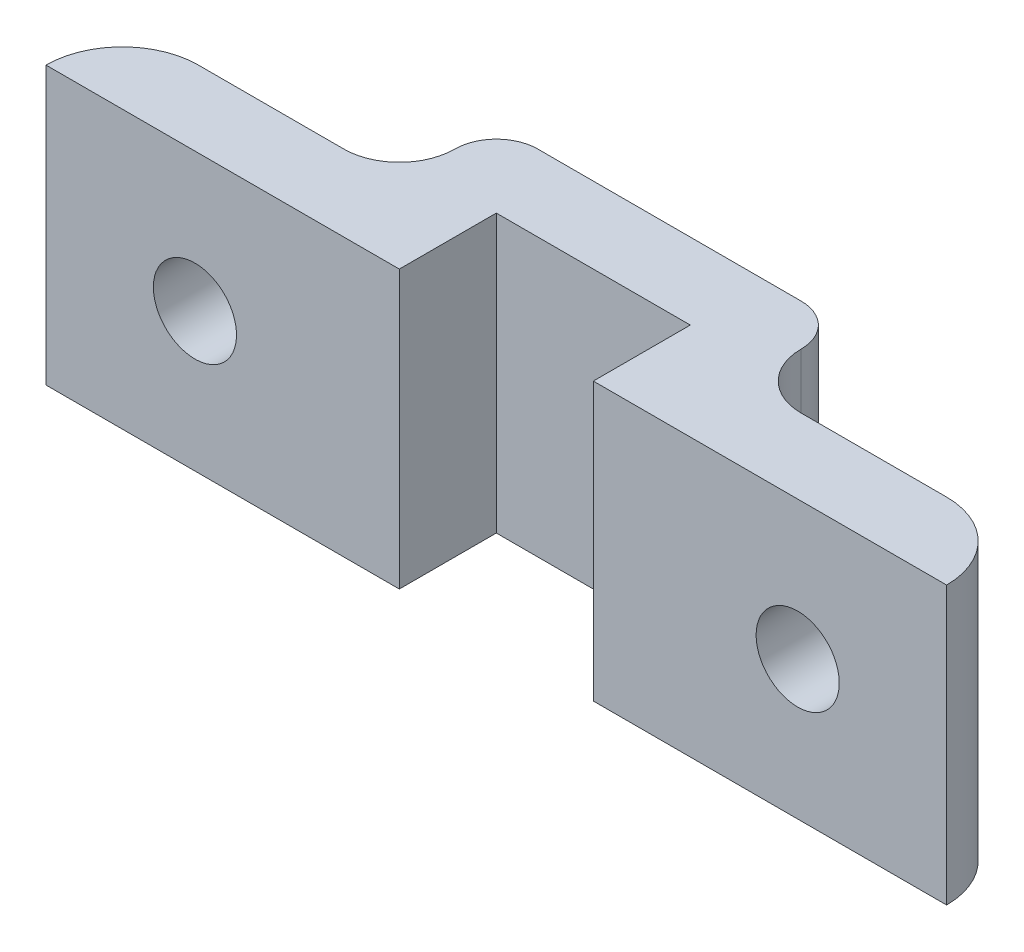
ISO-10303-21;
HEADER;
FILE_DESCRIPTION(('STEP AP214'),'2;1');
FILE_NAME('part.step','',(''),(''),'','','');
FILE_SCHEMA(('AUTOMOTIVE_DESIGN { 1 0 10303 214 1 1 1 1 }'));
ENDSEC;
DATA;
#1=APPLICATION_CONTEXT('core data for automotive mechanical design processes');
#2=APPLICATION_PROTOCOL_DEFINITION('international standard','automotive_design',2000,#1);
#3=PRODUCT_CONTEXT('',#1,'mechanical');
#4=PRODUCT('Part','Part','',(#3));
#5=PRODUCT_RELATED_PRODUCT_CATEGORY('part','',(#4));
#6=PRODUCT_DEFINITION_FORMATION('','',#4);
#7=PRODUCT_DEFINITION_CONTEXT('part definition',#1,'design');
#8=PRODUCT_DEFINITION('design','',#6,#7);
#9=PRODUCT_DEFINITION_SHAPE('','',#8);
#10=(LENGTH_UNIT() NAMED_UNIT(*) SI_UNIT(.MILLI.,.METRE.));
#11=(NAMED_UNIT(*) PLANE_ANGLE_UNIT() SI_UNIT($,.RADIAN.));
#12=(NAMED_UNIT(*) SI_UNIT($,.STERADIAN.) SOLID_ANGLE_UNIT());
#13=UNCERTAINTY_MEASURE_WITH_UNIT(LENGTH_MEASURE(1.E-05),#10,'distance_accuracy_value','');
#14=(GEOMETRIC_REPRESENTATION_CONTEXT(3) GLOBAL_UNCERTAINTY_ASSIGNED_CONTEXT((#13)) GLOBAL_UNIT_ASSIGNED_CONTEXT((#10,
#11,#12)) REPRESENTATION_CONTEXT('',''));
#15=CARTESIAN_POINT('',(0.,0.,0.));
#16=DIRECTION('',(0.,0.,1.));
#17=DIRECTION('',(1.,0.,0.));
#18=AXIS2_PLACEMENT_3D('',#15,#16,#17);
#19=CARTESIAN_POINT('',(-13.5,-10.,3.125));
#20=DIRECTION('',(0.,1.,0.));
#21=DIRECTION('',(0.,0.,1.));
#22=AXIS2_PLACEMENT_3D('',#19,#20,#21);
#23=CYLINDRICAL_SURFACE('',#22,2.75);
#24=CARTESIAN_POINT('',(-13.5,0.,3.125));
#25=DIRECTION('',(0.,-1.,0.));
#26=DIRECTION('',(0.,0.,-1.));
#27=AXIS2_PLACEMENT_3D('',#24,#25,#26);
#28=CIRCLE('',#27,2.75);
#29=CARTESIAN_POINT('',(-16.25,0.,3.125));
#30=VERTEX_POINT('',#29);
#31=CARTESIAN_POINT('',(-13.5,0.,0.375));
#32=VERTEX_POINT('',#31);
#33=EDGE_CURVE('E191',#30,#32,#28,.T.);
#34=ORIENTED_EDGE('',*,*,#33,.T.);
#35=DIRECTION('',(0.,1.,0.));
#36=VECTOR('',#35,1.);
#37=CARTESIAN_POINT('',(-13.5,-10.,0.375));
#38=LINE('',#37,#36);
#39=CARTESIAN_POINT('',(-13.5,-10.,0.375));
#40=VERTEX_POINT('',#39);
#41=EDGE_CURVE('E10',#40,#32,#38,.T.);
#42=ORIENTED_EDGE('',*,*,#41,.F.);
#43=CARTESIAN_POINT('',(-13.5,-10.,3.125));
#44=DIRECTION('',(0.,-1.,0.));
#45=DIRECTION('',(0.,0.,-1.));
#46=AXIS2_PLACEMENT_3D('',#43,#44,#45);
#47=CIRCLE('',#46,2.75);
#48=CARTESIAN_POINT('',(-16.25,-10.,3.125));
#49=VERTEX_POINT('',#48);
#50=EDGE_CURVE('E240',#49,#40,#47,.T.);
#51=ORIENTED_EDGE('',*,*,#50,.F.);
#52=DIRECTION('',(0.,1.,0.));
#53=VECTOR('',#52,1.);
#54=CARTESIAN_POINT('',(-16.25,-10.,3.125));
#55=LINE('',#54,#53);
#56=EDGE_CURVE('E187',#49,#30,#55,.T.);
#57=ORIENTED_EDGE('',*,*,#56,.T.);
#58=EDGE_LOOP('',(#34,#42,#51,#57));
#59=FACE_BOUND('',#58,.T.);
#60=ADVANCED_FACE('F16',(#59),#23,.T.);
#61=CARTESIAN_POINT('',(-10.875,-10.,0.375));
#62=DIRECTION('',(0.,0.,1.));
#63=DIRECTION('',(1.,0.,0.));
#64=AXIS2_PLACEMENT_3D('',#61,#62,#63);
#65=PLANE('',#64);
#66=CARTESIAN_POINT('',(-10.875,-5.,0.375));
#67=DIRECTION('',(0.,0.,-1.));
#68=DIRECTION('',(-1.,0.,0.));
#69=AXIS2_PLACEMENT_3D('',#66,#67,#68);
#70=CIRCLE('',#69,1.5);
#71=CARTESIAN_POINT('',(-12.375,-5.,0.375));
#72=VERTEX_POINT('',#71);
#73=EDGE_CURVE('E284',#72,#72,#70,.T.);
#74=ORIENTED_EDGE('',*,*,#73,.F.);
#75=EDGE_LOOP('',(#74));
#76=FACE_BOUND('',#75,.T.);
#77=DIRECTION('',(1.,0.,0.));
#78=VECTOR('',#77,1.);
#79=CARTESIAN_POINT('',(-10.875,0.,0.375));
#80=LINE('',#79,#78);
#81=CARTESIAN_POINT('',(-8.25,0.,0.375));
#82=VERTEX_POINT('',#81);
#83=EDGE_CURVE('E195',#32,#82,#80,.T.);
#84=ORIENTED_EDGE('',*,*,#83,.T.);
#85=DIRECTION('',(0.,1.,0.));
#86=VECTOR('',#85,1.);
#87=CARTESIAN_POINT('',(-8.25,-10.,0.375));
#88=LINE('',#87,#86);
#89=CARTESIAN_POINT('',(-8.25,-10.,0.375));
#90=VERTEX_POINT('',#89);
#91=EDGE_CURVE('E26',#90,#82,#88,.T.);
#92=ORIENTED_EDGE('',*,*,#91,.F.);
#93=DIRECTION('',(1.,0.,0.));
#94=VECTOR('',#93,1.);
#95=CARTESIAN_POINT('',(-10.875,-10.,0.375));
#96=LINE('',#95,#94);
#97=EDGE_CURVE('E115',#40,#90,#96,.T.);
#98=ORIENTED_EDGE('',*,*,#97,.F.);
#99=ORIENTED_EDGE('',*,*,#41,.T.);
#100=EDGE_LOOP('',(#84,#92,#98,#99));
#101=FACE_BOUND('',#100,.T.);
#102=ADVANCED_FACE('F350',(#76,#101),#65,.F.);
#103=CARTESIAN_POINT('',(-8.25,-10.,-1.625));
#104=DIRECTION('',(0.,1.,0.));
#105=DIRECTION('',(0.,0.,1.));
#106=AXIS2_PLACEMENT_3D('',#103,#104,#105);
#107=CYLINDRICAL_SURFACE('',#106,2.);
#108=CARTESIAN_POINT('',(-8.25,0.,-1.625));
#109=DIRECTION('',(0.,-1.,0.));
#110=DIRECTION('',(0.,0.,-1.));
#111=AXIS2_PLACEMENT_3D('',#108,#109,#110);
#112=CIRCLE('',#111,2.);
#113=CARTESIAN_POINT('',(-6.25,0.,-1.625));
#114=VERTEX_POINT('',#113);
#115=EDGE_CURVE('E199',#114,#82,#112,.T.);
#116=ORIENTED_EDGE('',*,*,#115,.F.);
#117=DIRECTION('',(0.,1.,0.));
#118=VECTOR('',#117,1.);
#119=CARTESIAN_POINT('',(-6.25,-10.,-1.625));
#120=LINE('',#119,#118);
#121=CARTESIAN_POINT('',(-6.25,-10.,-1.625));
#122=VERTEX_POINT('',#121);
#123=EDGE_CURVE('E268',#122,#114,#120,.T.);
#124=ORIENTED_EDGE('',*,*,#123,.F.);
#125=CARTESIAN_POINT('',(-8.25,-10.,-1.625));
#126=DIRECTION('',(0.,-1.,0.));
#127=DIRECTION('',(0.,0.,-1.));
#128=AXIS2_PLACEMENT_3D('',#125,#126,#127);
#129=CIRCLE('',#128,2.);
#130=EDGE_CURVE('E298',#122,#90,#129,.T.);
#131=ORIENTED_EDGE('',*,*,#130,.T.);
#132=ORIENTED_EDGE('',*,*,#91,.T.);
#133=EDGE_LOOP('',(#116,#124,#131,#132));
#134=FACE_BOUND('',#133,.T.);
#135=ADVANCED_FACE('F354',(#134),#107,.F.);
#136=CARTESIAN_POINT('',(-4.75,-10.,-1.625));
#137=DIRECTION('',(0.,1.,0.));
#138=DIRECTION('',(0.,0.,1.));
#139=AXIS2_PLACEMENT_3D('',#136,#137,#138);
#140=CYLINDRICAL_SURFACE('',#139,1.5);
#141=CARTESIAN_POINT('',(-4.75,0.,-1.625));
#142=DIRECTION('',(0.,-1.,0.));
#143=DIRECTION('',(0.,0.,-1.));
#144=AXIS2_PLACEMENT_3D('',#141,#142,#143);
#145=CIRCLE('',#144,1.5);
#146=CARTESIAN_POINT('',(-4.75,0.,-3.125));
#147=VERTEX_POINT('',#146);
#148=EDGE_CURVE('E203',#114,#147,#145,.T.);
#149=ORIENTED_EDGE('',*,*,#148,.T.);
#150=DIRECTION('',(0.,1.,0.));
#151=VECTOR('',#150,1.);
#152=CARTESIAN_POINT('',(-4.75,-10.,-3.125));
#153=LINE('',#152,#151);
#154=CARTESIAN_POINT('',(-4.75,-10.,-3.125));
#155=VERTEX_POINT('',#154);
#156=EDGE_CURVE('E265',#155,#147,#153,.T.);
#157=ORIENTED_EDGE('',*,*,#156,.F.);
#158=CARTESIAN_POINT('',(-4.75,-10.,-1.625));
#159=DIRECTION('',(0.,-1.,0.));
#160=DIRECTION('',(0.,0.,-1.));
#161=AXIS2_PLACEMENT_3D('',#158,#159,#160);
#162=CIRCLE('',#161,1.5);
#163=EDGE_CURVE('E302',#122,#155,#162,.T.);
#164=ORIENTED_EDGE('',*,*,#163,.F.);
#165=ORIENTED_EDGE('',*,*,#123,.T.);
#166=EDGE_LOOP('',(#149,#157,#164,#165));
#167=FACE_BOUND('',#166,.T.);
#168=ADVANCED_FACE('F359',(#167),#140,.T.);
#169=CARTESIAN_POINT('',(-4.125,-10.,-3.125));
#170=DIRECTION('',(0.,0.,-1.));
#171=DIRECTION('',(-1.,0.,0.));
#172=AXIS2_PLACEMENT_3D('',#169,#170,#171);
#173=PLANE('',#172);
#174=DIRECTION('',(-1.,0.,0.));
#175=VECTOR('',#174,1.);
#176=CARTESIAN_POINT('',(-4.125,0.,-3.125));
#177=LINE('',#176,#175);
#178=CARTESIAN_POINT('',(4.75,0.,-3.125));
#179=VERTEX_POINT('',#178);
#180=EDGE_CURVE('E207',#179,#147,#177,.T.);
#181=ORIENTED_EDGE('',*,*,#180,.F.);
#182=DIRECTION('',(0.,1.,0.));
#183=VECTOR('',#182,1.);
#184=CARTESIAN_POINT('',(4.75,-10.,-3.125));
#185=LINE('',#184,#183);
#186=CARTESIAN_POINT('',(4.75,-10.,-3.125));
#187=VERTEX_POINT('',#186);
#188=EDGE_CURVE('E262',#187,#179,#185,.T.);
#189=ORIENTED_EDGE('',*,*,#188,.F.);
#190=DIRECTION('',(-1.,0.,0.));
#191=VECTOR('',#190,1.);
#192=CARTESIAN_POINT('',(-4.125,-10.,-3.125));
#193=LINE('',#192,#191);
#194=EDGE_CURVE('E305',#187,#155,#193,.T.);
#195=ORIENTED_EDGE('',*,*,#194,.T.);
#196=ORIENTED_EDGE('',*,*,#156,.T.);
#197=EDGE_LOOP('',(#181,#189,#195,#196));
#198=FACE_BOUND('',#197,.T.);
#199=ADVANCED_FACE('F366',(#198),#173,.T.);
#200=CARTESIAN_POINT('',(4.75,-10.,-1.625));
#201=DIRECTION('',(0.,1.,0.));
#202=DIRECTION('',(0.,0.,1.));
#203=AXIS2_PLACEMENT_3D('',#200,#201,#202);
#204=CYLINDRICAL_SURFACE('',#203,1.5);
#205=CARTESIAN_POINT('',(4.75,0.,-1.625));
#206=DIRECTION('',(0.,-1.,0.));
#207=DIRECTION('',(0.,0.,-1.));
#208=AXIS2_PLACEMENT_3D('',#205,#206,#207);
#209=CIRCLE('',#208,1.5);
#210=CARTESIAN_POINT('',(6.25,0.,-1.625));
#211=VERTEX_POINT('',#210);
#212=EDGE_CURVE('E211',#179,#211,#209,.T.);
#213=ORIENTED_EDGE('',*,*,#212,.T.);
#214=DIRECTION('',(0.,1.,0.));
#215=VECTOR('',#214,1.);
#216=CARTESIAN_POINT('',(6.25,-10.,-1.625));
#217=LINE('',#216,#215);
#218=CARTESIAN_POINT('',(6.25,-10.,-1.625));
#219=VERTEX_POINT('',#218);
#220=EDGE_CURVE('E259',#219,#211,#217,.T.);
#221=ORIENTED_EDGE('',*,*,#220,.F.);
#222=CARTESIAN_POINT('',(4.75,-10.,-1.625));
#223=DIRECTION('',(0.,-1.,0.));
#224=DIRECTION('',(0.,0.,-1.));
#225=AXIS2_PLACEMENT_3D('',#222,#223,#224);
#226=CIRCLE('',#225,1.5);
#227=EDGE_CURVE('E309',#187,#219,#226,.T.);
#228=ORIENTED_EDGE('',*,*,#227,.F.);
#229=ORIENTED_EDGE('',*,*,#188,.T.);
#230=EDGE_LOOP('',(#213,#221,#228,#229));
#231=FACE_BOUND('',#230,.T.);
#232=ADVANCED_FACE('F370',(#231),#204,.T.);
#233=CARTESIAN_POINT('',(8.25,-10.,-1.625));
#234=DIRECTION('',(0.,1.,0.));
#235=DIRECTION('',(0.,0.,1.));
#236=AXIS2_PLACEMENT_3D('',#233,#234,#235);
#237=CYLINDRICAL_SURFACE('',#236,2.);
#238=CARTESIAN_POINT('',(8.25,0.,-1.625));
#239=DIRECTION('',(0.,-1.,0.));
#240=DIRECTION('',(0.,0.,-1.));
#241=AXIS2_PLACEMENT_3D('',#238,#239,#240);
#242=CIRCLE('',#241,2.);
#243=CARTESIAN_POINT('',(8.25,0.,0.375));
#244=VERTEX_POINT('',#243);
#245=EDGE_CURVE('E215',#244,#211,#242,.T.);
#246=ORIENTED_EDGE('',*,*,#245,.F.);
#247=DIRECTION('',(0.,1.,0.));
#248=VECTOR('',#247,1.);
#249=CARTESIAN_POINT('',(8.25,-10.,0.375));
#250=LINE('',#249,#248);
#251=CARTESIAN_POINT('',(8.25,-10.,0.375));
#252=VERTEX_POINT('',#251);
#253=EDGE_CURVE('E256',#252,#244,#250,.T.);
#254=ORIENTED_EDGE('',*,*,#253,.F.);
#255=CARTESIAN_POINT('',(8.25,-10.,-1.625));
#256=DIRECTION('',(0.,-1.,0.));
#257=DIRECTION('',(0.,0.,-1.));
#258=AXIS2_PLACEMENT_3D('',#255,#256,#257);
#259=CIRCLE('',#258,2.);
#260=EDGE_CURVE('E312',#252,#219,#259,.T.);
#261=ORIENTED_EDGE('',*,*,#260,.T.);
#262=ORIENTED_EDGE('',*,*,#220,.T.);
#263=EDGE_LOOP('',(#246,#254,#261,#262));
#264=FACE_BOUND('',#263,.T.);
#265=ADVANCED_FACE('F374',(#264),#237,.F.);
#266=CARTESIAN_POINT('',(10.875,-10.,0.375));
#267=DIRECTION('',(0.,0.,-1.));
#268=DIRECTION('',(-1.,0.,0.));
#269=AXIS2_PLACEMENT_3D('',#266,#267,#268);
#270=PLANE('',#269);
#271=CARTESIAN_POINT('',(10.875,-5.,0.375));
#272=DIRECTION('',(0.,0.,-1.));
#273=DIRECTION('',(-1.,0.,0.));
#274=AXIS2_PLACEMENT_3D('',#271,#272,#273);
#275=CIRCLE('',#274,1.5);
#276=CARTESIAN_POINT('',(9.375,-5.,0.375));
#277=VERTEX_POINT('',#276);
#278=EDGE_CURVE('E275',#277,#277,#275,.T.);
#279=ORIENTED_EDGE('',*,*,#278,.F.);
#280=EDGE_LOOP('',(#279));
#281=FACE_BOUND('',#280,.T.);
#282=DIRECTION('',(-1.,0.,0.));
#283=VECTOR('',#282,1.);
#284=CARTESIAN_POINT('',(10.875,0.,0.375));
#285=LINE('',#284,#283);
#286=CARTESIAN_POINT('',(13.5,0.,0.375));
#287=VERTEX_POINT('',#286);
#288=EDGE_CURVE('E219',#287,#244,#285,.T.);
#289=ORIENTED_EDGE('',*,*,#288,.F.);
#290=DIRECTION('',(0.,1.,0.));
#291=VECTOR('',#290,1.);
#292=CARTESIAN_POINT('',(13.5,-10.,0.375));
#293=LINE('',#292,#291);
#294=CARTESIAN_POINT('',(13.5,-10.,0.375));
#295=VERTEX_POINT('',#294);
#296=EDGE_CURVE('E253',#295,#287,#293,.T.);
#297=ORIENTED_EDGE('',*,*,#296,.F.);
#298=DIRECTION('',(-1.,0.,0.));
#299=VECTOR('',#298,1.);
#300=CARTESIAN_POINT('',(10.875,-10.,0.375));
#301=LINE('',#300,#299);
#302=EDGE_CURVE('E316',#295,#252,#301,.T.);
#303=ORIENTED_EDGE('',*,*,#302,.T.);
#304=ORIENTED_EDGE('',*,*,#253,.T.);
#305=EDGE_LOOP('',(#289,#297,#303,#304));
#306=FACE_BOUND('',#305,.T.);
#307=ADVANCED_FACE('F378',(#281,#306),#270,.T.);
#308=CARTESIAN_POINT('',(13.5,-10.,3.125));
#309=DIRECTION('',(0.,1.,0.));
#310=DIRECTION('',(0.,0.,1.));
#311=AXIS2_PLACEMENT_3D('',#308,#309,#310);
#312=CYLINDRICAL_SURFACE('',#311,2.75);
#313=CARTESIAN_POINT('',(13.5,0.,3.125));
#314=DIRECTION('',(0.,-1.,0.));
#315=DIRECTION('',(0.,0.,-1.));
#316=AXIS2_PLACEMENT_3D('',#313,#314,#315);
#317=CIRCLE('',#316,2.75);
#318=CARTESIAN_POINT('',(16.25,0.,3.125));
#319=VERTEX_POINT('',#318);
#320=EDGE_CURVE('E223',#287,#319,#317,.T.);
#321=ORIENTED_EDGE('',*,*,#320,.T.);
#322=DIRECTION('',(0.,1.,0.));
#323=VECTOR('',#322,1.);
#324=CARTESIAN_POINT('',(16.25,-10.,3.125));
#325=LINE('',#324,#323);
#326=CARTESIAN_POINT('',(16.25,-10.,3.125));
#327=VERTEX_POINT('',#326);
#328=EDGE_CURVE('E250',#327,#319,#325,.T.);
#329=ORIENTED_EDGE('',*,*,#328,.F.);
#330=CARTESIAN_POINT('',(13.5,-10.,3.125));
#331=DIRECTION('',(0.,-1.,0.));
#332=DIRECTION('',(0.,0.,-1.));
#333=AXIS2_PLACEMENT_3D('',#330,#331,#332);
#334=CIRCLE('',#333,2.75);
#335=EDGE_CURVE('E320',#295,#327,#334,.T.);
#336=ORIENTED_EDGE('',*,*,#335,.F.);
#337=ORIENTED_EDGE('',*,*,#296,.T.);
#338=EDGE_LOOP('',(#321,#329,#336,#337));
#339=FACE_BOUND('',#338,.T.);
#340=ADVANCED_FACE('F382',(#339),#312,.T.);
#341=CARTESIAN_POINT('',(11.25,-10.,3.125));
#342=DIRECTION('',(0.,0.,1.));
#343=DIRECTION('',(1.,0.,0.));
#344=AXIS2_PLACEMENT_3D('',#341,#342,#343);
#345=PLANE('',#344);
#346=CARTESIAN_POINT('',(10.875,-5.,3.125));
#347=DIRECTION('',(0.,0.,1.));
#348=DIRECTION('',(1.,0.,0.));
#349=AXIS2_PLACEMENT_3D('',#346,#347,#348);
#350=CIRCLE('',#349,1.5);
#351=CARTESIAN_POINT('',(12.375,-5.,3.125));
#352=VERTEX_POINT('',#351);
#353=EDGE_CURVE('E19',#352,#352,#350,.T.);
#354=ORIENTED_EDGE('',*,*,#353,.F.);
#355=EDGE_LOOP('',(#354));
#356=FACE_BOUND('',#355,.T.);
#357=DIRECTION('',(1.,0.,0.));
#358=VECTOR('',#357,1.);
#359=CARTESIAN_POINT('',(11.25,0.,3.125));
#360=LINE('',#359,#358);
#361=CARTESIAN_POINT('',(3.5,0.,3.125));
#362=VERTEX_POINT('',#361);
#363=EDGE_CURVE('E227',#362,#319,#360,.T.);
#364=ORIENTED_EDGE('',*,*,#363,.F.);
#365=DIRECTION('',(0.,1.,0.));
#366=VECTOR('',#365,1.);
#367=CARTESIAN_POINT('',(3.5,-10.,3.125));
#368=LINE('',#367,#366);
#369=CARTESIAN_POINT('',(3.5,-10.,3.125));
#370=VERTEX_POINT('',#369);
#371=EDGE_CURVE('E247',#370,#362,#368,.T.);
#372=ORIENTED_EDGE('',*,*,#371,.F.);
#373=DIRECTION('',(1.,0.,0.));
#374=VECTOR('',#373,1.);
#375=CARTESIAN_POINT('',(11.25,-10.,3.125));
#376=LINE('',#375,#374);
#377=EDGE_CURVE('E323',#370,#327,#376,.T.);
#378=ORIENTED_EDGE('',*,*,#377,.T.);
#379=ORIENTED_EDGE('',*,*,#328,.T.);
#380=EDGE_LOOP('',(#364,#372,#378,#379));
#381=FACE_BOUND('',#380,.T.);
#382=ADVANCED_FACE('F386',(#356,#381),#345,.T.);
#383=CARTESIAN_POINT('',(3.5,-10.,1.375));
#384=DIRECTION('',(-1.,0.,0.));
#385=DIRECTION('',(0.,0.,1.));
#386=AXIS2_PLACEMENT_3D('',#383,#384,#385);
#387=PLANE('',#386);
#388=DIRECTION('',(0.,0.,1.));
#389=VECTOR('',#388,1.);
#390=CARTESIAN_POINT('',(3.5,0.,1.375));
#391=LINE('',#390,#389);
#392=CARTESIAN_POINT('',(3.5,0.,-0.375));
#393=VERTEX_POINT('',#392);
#394=EDGE_CURVE('E231',#393,#362,#391,.T.);
#395=ORIENTED_EDGE('',*,*,#394,.F.);
#396=DIRECTION('',(0.,1.,0.));
#397=VECTOR('',#396,1.);
#398=CARTESIAN_POINT('',(3.5,-10.,-0.375));
#399=LINE('',#398,#397);
#400=CARTESIAN_POINT('',(3.5,-10.,-0.375));
#401=VERTEX_POINT('',#400);
#402=EDGE_CURVE('E170',#401,#393,#399,.T.);
#403=ORIENTED_EDGE('',*,*,#402,.F.);
#404=DIRECTION('',(0.,0.,1.));
#405=VECTOR('',#404,1.);
#406=CARTESIAN_POINT('',(3.5,-10.,1.375));
#407=LINE('',#406,#405);
#408=EDGE_CURVE('E177',#401,#370,#407,.T.);
#409=ORIENTED_EDGE('',*,*,#408,.T.);
#410=ORIENTED_EDGE('',*,*,#371,.T.);
#411=EDGE_LOOP('',(#395,#403,#409,#410));
#412=FACE_BOUND('',#411,.T.);
#413=ADVANCED_FACE('F330',(#412),#387,.T.);
#414=CARTESIAN_POINT('',(0.,-10.,-0.375));
#415=DIRECTION('',(0.,0.,1.));
#416=DIRECTION('',(1.,0.,0.));
#417=AXIS2_PLACEMENT_3D('',#414,#415,#416);
#418=PLANE('',#417);
#419=DIRECTION('',(1.,0.,0.));
#420=VECTOR('',#419,1.);
#421=CARTESIAN_POINT('',(0.,0.,-0.375));
#422=LINE('',#421,#420);
#423=CARTESIAN_POINT('',(-3.5,0.,-0.375));
#424=VERTEX_POINT('',#423);
#425=EDGE_CURVE('E164',#424,#393,#422,.T.);
#426=ORIENTED_EDGE('',*,*,#425,.F.);
#427=DIRECTION('',(0.,1.,0.));
#428=VECTOR('',#427,1.);
#429=CARTESIAN_POINT('',(-3.5,-10.,-0.375));
#430=LINE('',#429,#428);
#431=CARTESIAN_POINT('',(-3.5,-10.,-0.375));
#432=VERTEX_POINT('',#431);
#433=EDGE_CURVE('E159',#432,#424,#430,.T.);
#434=ORIENTED_EDGE('',*,*,#433,.F.);
#435=DIRECTION('',(1.,0.,0.));
#436=VECTOR('',#435,1.);
#437=CARTESIAN_POINT('',(0.,-10.,-0.375));
#438=LINE('',#437,#436);
#439=EDGE_CURVE('E162',#432,#401,#438,.T.);
#440=ORIENTED_EDGE('',*,*,#439,.T.);
#441=ORIENTED_EDGE('',*,*,#402,.T.);
#442=EDGE_LOOP('',(#426,#434,#440,#441));
#443=FACE_BOUND('',#442,.T.);
#444=ADVANCED_FACE('F161',(#443),#418,.T.);
#445=CARTESIAN_POINT('',(-3.5,-10.,1.375));
#446=DIRECTION('',(1.,0.,0.));
#447=DIRECTION('',(0.,0.,-1.));
#448=AXIS2_PLACEMENT_3D('',#445,#446,#447);
#449=PLANE('',#448);
#450=DIRECTION('',(0.,0.,-1.));
#451=VECTOR('',#450,1.);
#452=CARTESIAN_POINT('',(-3.5,0.,1.375));
#453=LINE('',#452,#451);
#454=CARTESIAN_POINT('',(-3.5,0.,3.125));
#455=VERTEX_POINT('',#454);
#456=EDGE_CURVE('E236',#455,#424,#453,.T.);
#457=ORIENTED_EDGE('',*,*,#456,.F.);
#458=DIRECTION('',(0.,1.,0.));
#459=VECTOR('',#458,1.);
#460=CARTESIAN_POINT('',(-3.5,-10.,3.125));
#461=LINE('',#460,#459);
#462=CARTESIAN_POINT('',(-3.5,-10.,3.125));
#463=VERTEX_POINT('',#462);
#464=EDGE_CURVE('E100',#463,#455,#461,.T.);
#465=ORIENTED_EDGE('',*,*,#464,.F.);
#466=DIRECTION('',(0.,0.,-1.));
#467=VECTOR('',#466,1.);
#468=CARTESIAN_POINT('',(-3.5,-10.,1.375));
#469=LINE('',#468,#467);
#470=EDGE_CURVE('E174',#463,#432,#469,.T.);
#471=ORIENTED_EDGE('',*,*,#470,.T.);
#472=ORIENTED_EDGE('',*,*,#433,.T.);
#473=EDGE_LOOP('',(#457,#465,#471,#472));
#474=FACE_BOUND('',#473,.T.);
#475=ADVANCED_FACE('F180',(#474),#449,.T.);
#476=CARTESIAN_POINT('',(-4.875,-10.,3.125));
#477=DIRECTION('',(0.,0.,-1.));
#478=DIRECTION('',(-1.,0.,0.));
#479=AXIS2_PLACEMENT_3D('',#476,#477,#478);
#480=PLANE('',#479);
#481=CARTESIAN_POINT('',(-10.875,-5.,3.125));
#482=DIRECTION('',(0.,0.,-1.));
#483=DIRECTION('',(-1.,0.,0.));
#484=AXIS2_PLACEMENT_3D('',#481,#482,#483);
#485=CIRCLE('',#484,1.5);
#486=CARTESIAN_POINT('',(-12.375,-5.,3.125));
#487=VERTEX_POINT('',#486);
#488=EDGE_CURVE('E272',#487,#487,#485,.T.);
#489=ORIENTED_EDGE('',*,*,#488,.T.);
#490=EDGE_LOOP('',(#489));
#491=FACE_BOUND('',#490,.T.);
#492=DIRECTION('',(-1.,0.,0.));
#493=VECTOR('',#492,1.);
#494=CARTESIAN_POINT('',(-4.875,0.,3.125));
#495=LINE('',#494,#493);
#496=EDGE_CURVE('E105',#455,#30,#495,.T.);
#497=ORIENTED_EDGE('',*,*,#496,.T.);
#498=ORIENTED_EDGE('',*,*,#56,.F.);
#499=DIRECTION('',(-1.,0.,0.));
#500=VECTOR('',#499,1.);
#501=CARTESIAN_POINT('',(-4.875,-10.,3.125));
#502=LINE('',#501,#500);
#503=EDGE_CURVE('E40',#463,#49,#502,.T.);
#504=ORIENTED_EDGE('',*,*,#503,.F.);
#505=ORIENTED_EDGE('',*,*,#464,.T.);
#506=EDGE_LOOP('',(#497,#498,#504,#505));
#507=FACE_BOUND('',#506,.T.);
#508=ADVANCED_FACE('F338',(#491,#507),#480,.F.);
#509=CARTESIAN_POINT('',(0.,-10.,0.));
#510=DIRECTION('',(0.,-1.,0.));
#511=DIRECTION('',(1.,0.,0.));
#512=AXIS2_PLACEMENT_3D('',#509,#510,#511);
#513=PLANE('',#512);
#514=ORIENTED_EDGE('',*,*,#50,.T.);
#515=ORIENTED_EDGE('',*,*,#97,.T.);
#516=ORIENTED_EDGE('',*,*,#130,.F.);
#517=ORIENTED_EDGE('',*,*,#163,.T.);
#518=ORIENTED_EDGE('',*,*,#194,.F.);
#519=ORIENTED_EDGE('',*,*,#227,.T.);
#520=ORIENTED_EDGE('',*,*,#260,.F.);
#521=ORIENTED_EDGE('',*,*,#302,.F.);
#522=ORIENTED_EDGE('',*,*,#335,.T.);
#523=ORIENTED_EDGE('',*,*,#377,.F.);
#524=ORIENTED_EDGE('',*,*,#408,.F.);
#525=ORIENTED_EDGE('',*,*,#439,.F.);
#526=ORIENTED_EDGE('',*,*,#470,.F.);
#527=ORIENTED_EDGE('',*,*,#503,.T.);
#528=EDGE_LOOP('',(#514,#515,#516,#517,#518,#519,#520,#521,#522,#523,#524,#525,#526,#527));
#529=FACE_BOUND('',#528,.T.);
#530=ADVANCED_FACE('F173',(#529),#513,.T.);
#531=CARTESIAN_POINT('',(0.,0.,0.));
#532=DIRECTION('',(0.,-1.,0.));
#533=DIRECTION('',(1.,0.,0.));
#534=AXIS2_PLACEMENT_3D('',#531,#532,#533);
#535=PLANE('',#534);
#536=ORIENTED_EDGE('',*,*,#33,.F.);
#537=ORIENTED_EDGE('',*,*,#496,.F.);
#538=ORIENTED_EDGE('',*,*,#456,.T.);
#539=ORIENTED_EDGE('',*,*,#425,.T.);
#540=ORIENTED_EDGE('',*,*,#394,.T.);
#541=ORIENTED_EDGE('',*,*,#363,.T.);
#542=ORIENTED_EDGE('',*,*,#320,.F.);
#543=ORIENTED_EDGE('',*,*,#288,.T.);
#544=ORIENTED_EDGE('',*,*,#245,.T.);
#545=ORIENTED_EDGE('',*,*,#212,.F.);
#546=ORIENTED_EDGE('',*,*,#180,.T.);
#547=ORIENTED_EDGE('',*,*,#148,.F.);
#548=ORIENTED_EDGE('',*,*,#115,.T.);
#549=ORIENTED_EDGE('',*,*,#83,.F.);
#550=EDGE_LOOP('',(#536,#537,#538,#539,#540,#541,#542,#543,#544,#545,#546,#547,#548,#549));
#551=FACE_BOUND('',#550,.T.);
#552=ADVANCED_FACE('F334',(#551),#535,.F.);
#553=CARTESIAN_POINT('',(-10.875,-5.,25.375));
#554=DIRECTION('',(0.,0.,-1.));
#555=DIRECTION('',(-1.,0.,0.));
#556=AXIS2_PLACEMENT_3D('',#553,#554,#555);
#557=CYLINDRICAL_SURFACE('',#556,1.5);
#558=ORIENTED_EDGE('',*,*,#73,.T.);
#559=EDGE_LOOP('',(#558));
#560=FACE_BOUND('',#559,.T.);
#561=ORIENTED_EDGE('',*,*,#488,.F.);
#562=EDGE_LOOP('',(#561));
#563=FACE_BOUND('',#562,.T.);
#564=ADVANCED_FACE('F410',(#560,#563),#557,.F.);
#565=CARTESIAN_POINT('',(10.875,-5.,25.375));
#566=DIRECTION('',(0.,0.,-1.));
#567=DIRECTION('',(-1.,0.,0.));
#568=AXIS2_PLACEMENT_3D('',#565,#566,#567);
#569=CYLINDRICAL_SURFACE('',#568,1.5);
#570=ORIENTED_EDGE('',*,*,#353,.T.);
#571=EDGE_LOOP('',(#570));
#572=FACE_BOUND('',#571,.T.);
#573=ORIENTED_EDGE('',*,*,#278,.T.);
#574=EDGE_LOOP('',(#573));
#575=FACE_BOUND('',#574,.T.);
#576=ADVANCED_FACE('F417',(#572,#575),#569,.F.);
#577=CLOSED_SHELL('',(#60,#102,#135,#168,#199,#232,#265,#307,#340,#382,#413,#444,#475,#508,#530,
#552,#564,#576));
#578=MANIFOLD_SOLID_BREP('B1',#577);
#579=ADVANCED_BREP_SHAPE_REPRESENTATION('',(#18,#578),#14);
#580=SHAPE_DEFINITION_REPRESENTATION(#9,#579);
ENDSEC;
END-ISO-10303-21;
